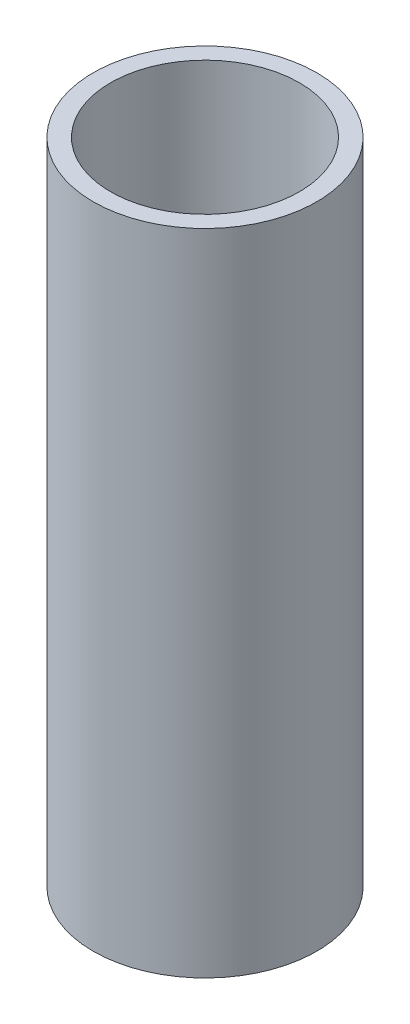
ISO-10303-21;
HEADER;
FILE_DESCRIPTION(('STEP AP214'),'2;1');
FILE_NAME('part.step','',(''),(''),'','','');
FILE_SCHEMA(('AUTOMOTIVE_DESIGN { 1 0 10303 214 1 1 1 1 }'));
ENDSEC;
DATA;
#1=APPLICATION_CONTEXT('core data for automotive mechanical design processes');
#2=APPLICATION_PROTOCOL_DEFINITION('international standard','automotive_design',2000,#1);
#3=PRODUCT_CONTEXT('',#1,'mechanical');
#4=PRODUCT('Part','Part','',(#3));
#5=PRODUCT_RELATED_PRODUCT_CATEGORY('part','',(#4));
#6=PRODUCT_DEFINITION_FORMATION('','',#4);
#7=PRODUCT_DEFINITION_CONTEXT('part definition',#1,'design');
#8=PRODUCT_DEFINITION('design','',#6,#7);
#9=PRODUCT_DEFINITION_SHAPE('','',#8);
#10=(LENGTH_UNIT() NAMED_UNIT(*) SI_UNIT(.MILLI.,.METRE.));
#11=(NAMED_UNIT(*) PLANE_ANGLE_UNIT() SI_UNIT($,.RADIAN.));
#12=(NAMED_UNIT(*) SI_UNIT($,.STERADIAN.) SOLID_ANGLE_UNIT());
#13=UNCERTAINTY_MEASURE_WITH_UNIT(LENGTH_MEASURE(1.E-05),#10,'distance_accuracy_value','');
#14=(GEOMETRIC_REPRESENTATION_CONTEXT(3) GLOBAL_UNCERTAINTY_ASSIGNED_CONTEXT((#13)) GLOBAL_UNIT_ASSIGNED_CONTEXT((#10,
#11,#12)) REPRESENTATION_CONTEXT('',''));
#15=CARTESIAN_POINT('',(0.,0.,0.));
#16=DIRECTION('',(0.,0.,1.));
#17=DIRECTION('',(1.,0.,0.));
#18=AXIS2_PLACEMENT_3D('',#15,#16,#17);
#19=CARTESIAN_POINT('',(0.,116.130624260028,0.));
#20=DIRECTION('',(0.,-1.,0.));
#21=DIRECTION('',(0.,0.,-1.));
#22=AXIS2_PLACEMENT_3D('',#19,#20,#21);
#23=CYLINDRICAL_SURFACE('',#22,20.);
#24=CARTESIAN_POINT('',(0.,116.130624260028,0.));
#25=DIRECTION('',(0.,1.,0.));
#26=DIRECTION('',(0.,0.,1.));
#27=AXIS2_PLACEMENT_3D('',#24,#25,#26);
#28=CIRCLE('',#27,20.);
#29=CARTESIAN_POINT('',(0.,116.130624260028,-20.));
#30=VERTEX_POINT('',#29);
#31=EDGE_CURVE('E10',#30,#30,#28,.T.);
#32=CARTESIAN_POINT('',(0.,0.,0.));
#33=DIRECTION('',(0.,1.,0.));
#34=DIRECTION('',(0.,0.,1.));
#35=AXIS2_PLACEMENT_3D('',#32,#33,#34);
#36=CIRCLE('',#35,20.);
#37=CARTESIAN_POINT('',(0.,0.,-20.));
#38=VERTEX_POINT('',#37);
#39=EDGE_CURVE('E37',#38,#38,#36,.T.);
#40=CARTESIAN_POINT('',(0.,116.130624260028,-20.));
#41=CARTESIAN_POINT('',(0.,114.920930257319,-20.));
#42=CARTESIAN_POINT('',(0.,113.711236254611,-20.));
#43=CARTESIAN_POINT('',(0.,111.291848249193,-20.));
#44=CARTESIAN_POINT('',(0.,110.082154246485,-20.));
#45=CARTESIAN_POINT('',(0.,107.662766241067,-20.));
#46=CARTESIAN_POINT('',(0.,106.453072238359,-20.));
#47=CARTESIAN_POINT('',(0.,104.033684232942,-20.));
#48=CARTESIAN_POINT('',(0.,102.823990230233,-20.));
#49=CARTESIAN_POINT('',(0.,100.404602224816,-20.));
#50=CARTESIAN_POINT('',(0.,99.1949082221071,-20.));
#51=CARTESIAN_POINT('',(0.,96.7755202166899,-20.));
#52=CARTESIAN_POINT('',(0.,95.5658262139813,-20.));
#53=CARTESIAN_POINT('',(0.,93.146438208564,-20.));
#54=CARTESIAN_POINT('',(0.,91.9367442058554,-20.));
#55=CARTESIAN_POINT('',(0.,89.5173562004381,-20.));
#56=CARTESIAN_POINT('',(0.,88.3076621977295,-20.));
#57=CARTESIAN_POINT('',(0.,85.8882741923123,-20.));
#58=CARTESIAN_POINT('',(0.,84.6785801896036,-20.));
#59=CARTESIAN_POINT('',(0.,82.2591921841864,-20.));
#60=CARTESIAN_POINT('',(0.,81.0494981814778,-20.));
#61=CARTESIAN_POINT('',(0.,78.6301101760605,-20.));
#62=CARTESIAN_POINT('',(0.,77.4204161733519,-20.));
#63=CARTESIAN_POINT('',(0.,75.0010281679347,-20.));
#64=CARTESIAN_POINT('',(0.,73.791334165226,-20.));
#65=CARTESIAN_POINT('',(0.,71.3719461598088,-20.));
#66=CARTESIAN_POINT('',(0.,70.1622521571002,-20.));
#67=CARTESIAN_POINT('',(0.,67.7428641516829,-20.));
#68=CARTESIAN_POINT('',(0.,66.5331701489743,-20.));
#69=CARTESIAN_POINT('',(0.,64.113782143557,-20.));
#70=CARTESIAN_POINT('',(0.,62.9040881408484,-20.));
#71=CARTESIAN_POINT('',(0.,60.4847001354312,-20.));
#72=CARTESIAN_POINT('',(0.,59.2750061327226,-20.));
#73=CARTESIAN_POINT('',(0.,56.8556181273053,-20.));
#74=CARTESIAN_POINT('',(0.,55.6459241245967,-20.));
#75=CARTESIAN_POINT('',(0.,53.2265361191794,-20.));
#76=CARTESIAN_POINT('',(0.,52.0168421164708,-20.));
#77=CARTESIAN_POINT('',(0.,49.5974541110536,-20.));
#78=CARTESIAN_POINT('',(0.,48.3877601083449,-20.));
#79=CARTESIAN_POINT('',(0.,45.9683721029277,-20.));
#80=CARTESIAN_POINT('',(0.,44.7586781002191,-20.));
#81=CARTESIAN_POINT('',(0.,42.3392900948018,-20.));
#82=CARTESIAN_POINT('',(0.,41.1295960920932,-20.));
#83=CARTESIAN_POINT('',(0.,38.710208086676,-20.));
#84=CARTESIAN_POINT('',(0.,37.5005140839673,-20.));
#85=CARTESIAN_POINT('',(0.,35.0811260785501,-20.));
#86=CARTESIAN_POINT('',(0.,33.8714320758415,-20.));
#87=CARTESIAN_POINT('',(0.,31.4520440704242,-20.));
#88=CARTESIAN_POINT('',(0.,30.2423500677156,-20.));
#89=CARTESIAN_POINT('',(0.,27.8229620622983,-20.));
#90=CARTESIAN_POINT('',(0.,26.6132680595897,-20.));
#91=CARTESIAN_POINT('',(0.,24.1938800541725,-20.));
#92=CARTESIAN_POINT('',(0.,22.9841860514639,-20.));
#93=CARTESIAN_POINT('',(0.,20.5647980460466,-20.));
#94=CARTESIAN_POINT('',(0.,19.355104043338,-20.));
#95=CARTESIAN_POINT('',(0.,16.9357160379207,-20.));
#96=CARTESIAN_POINT('',(0.,15.7260220352121,-20.));
#97=CARTESIAN_POINT('',(0.,13.3066340297949,-20.));
#98=CARTESIAN_POINT('',(0.,12.0969400270862,-20.));
#99=CARTESIAN_POINT('',(0.,9.67755202166899,-20.));
#100=CARTESIAN_POINT('',(0.,8.46785801896037,-20.));
#101=CARTESIAN_POINT('',(0.,6.04847001354312,-20.));
#102=CARTESIAN_POINT('',(0.,4.83877601083449,-20.));
#103=CARTESIAN_POINT('',(0.,2.41938800541724,-20.));
#104=CARTESIAN_POINT('',(0.,1.20969400270862,-20.));
#105=CARTESIAN_POINT('',(0.,0.,-20.));
#106=B_SPLINE_CURVE_WITH_KNOTS('',3,(#40,#41,#42,#43,#44,#45,#46,#47,#48,#49,#50,#51,#52,#53,
#54,#55,#56,#57,#58,#59,#60,#61,#62,#63,#64,#65,#66,#67,#68,#69,#70,#71,#72,#73,#74,#75,#76,#77,
#78,#79,#80,#81,#82,#83,#84,#85,#86,#87,#88,#89,#90,#91,#92,#93,#94,#95,#96,#97,#98,#99,#100,
#101,#102,#103,#104,#105),.UNSPECIFIED.,.F.,.F.,(4,2,2,2,2,2,2,2,2,2,2,2,2,2,2,2,2,2,2,2,2,2,2,
2,2,2,2,2,2,2,2,2,4),(0.,3.62908200812587,7.25816401625173,10.8872460243776,14.5163280325035,
18.1454100406293,21.7744920487552,25.4035740568811,29.032656065007,32.6617380731328,
36.2908200812587,39.9199020893846,43.5489840975104,47.1780661056363,50.8071481137622,
54.436230121888,58.0653121300139,61.6943941381398,65.3234761462657,68.9525581543915,
72.5816401625174,76.2107221706433,79.8398041787691,83.468886186895,87.0979681950209,
90.7270502031467,94.3561322112726,97.9852142193985,101.614296227524,105.24337823565,
108.872460243776,112.501542251902,116.130624260028),.UNSPECIFIED.);
#107=EDGE_CURVE('BSEAM40',#30,#38,#106,.T.);
#108=ORIENTED_EDGE('',*,*,#31,.F.);
#109=ORIENTED_EDGE('',*,*,#39,.T.);
#110=ORIENTED_EDGE('',*,*,#107,.T.);
#111=ORIENTED_EDGE('',*,*,#107,.F.);
#112=EDGE_LOOP('',(#108,#110,#109,#111));
#113=FACE_BOUND('',#112,.T.);
#114=ADVANCED_FACE('F40',(#113),#23,.T.);
#115=CARTESIAN_POINT('',(0.,116.130624260028,0.));
#116=DIRECTION('',(0.,1.,0.));
#117=DIRECTION('',(0.,0.,1.));
#118=AXIS2_PLACEMENT_3D('',#115,#116,#117);
#119=PLANE('',#118);
#120=CARTESIAN_POINT('',(0.,116.130624260028,0.));
#121=DIRECTION('',(0.,1.,0.));
#122=DIRECTION('',(0.,0.,1.));
#123=AXIS2_PLACEMENT_3D('',#120,#121,#122);
#124=CIRCLE('',#123,16.8988126896445);
#125=CARTESIAN_POINT('',(0.,116.130624260028,-16.8988126896445));
#126=VERTEX_POINT('',#125);
#127=EDGE_CURVE('E50',#126,#126,#124,.T.);
#128=ORIENTED_EDGE('',*,*,#127,.F.);
#129=EDGE_LOOP('',(#128));
#130=FACE_BOUND('',#129,.T.);
#131=ORIENTED_EDGE('',*,*,#31,.T.);
#132=EDGE_LOOP('',(#131));
#133=FACE_BOUND('',#132,.T.);
#134=ADVANCED_FACE('F59',(#130,#133),#119,.T.);
#135=CARTESIAN_POINT('',(0.,0.,0.));
#136=DIRECTION('',(0.,1.,0.));
#137=DIRECTION('',(0.,0.,1.));
#138=AXIS2_PLACEMENT_3D('',#135,#136,#137);
#139=PLANE('',#138);
#140=CARTESIAN_POINT('',(0.,0.,0.));
#141=DIRECTION('',(0.,1.,0.));
#142=DIRECTION('',(0.,0.,1.));
#143=AXIS2_PLACEMENT_3D('',#140,#141,#142);
#144=CIRCLE('',#143,16.8988126896445);
#145=CARTESIAN_POINT('',(0.,0.,-16.8988126896445));
#146=VERTEX_POINT('',#145);
#147=EDGE_CURVE('E47',#146,#146,#144,.T.);
#148=ORIENTED_EDGE('',*,*,#147,.T.);
#149=EDGE_LOOP('',(#148));
#150=FACE_BOUND('',#149,.T.);
#151=ORIENTED_EDGE('',*,*,#39,.F.);
#152=EDGE_LOOP('',(#151));
#153=FACE_BOUND('',#152,.T.);
#154=ADVANCED_FACE('F58',(#150,#153),#139,.F.);
#155=CARTESIAN_POINT('',(0.,116.130624260028,0.));
#156=DIRECTION('',(0.,-1.,0.));
#157=DIRECTION('',(0.,0.,-1.));
#158=AXIS2_PLACEMENT_3D('',#155,#156,#157);
#159=CYLINDRICAL_SURFACE('',#158,16.8988126896445);
#160=CARTESIAN_POINT('',(0.,116.130624260028,-16.8988126896445));
#161=CARTESIAN_POINT('',(0.,114.920930257319,-16.8988126896445));
#162=CARTESIAN_POINT('',(0.,113.711236254611,-16.8988126896445));
#163=CARTESIAN_POINT('',(0.,111.291848249193,-16.8988126896445));
#164=CARTESIAN_POINT('',(0.,110.082154246485,-16.8988126896445));
#165=CARTESIAN_POINT('',(0.,107.662766241067,-16.8988126896445));
#166=CARTESIAN_POINT('',(0.,106.453072238359,-16.8988126896445));
#167=CARTESIAN_POINT('',(0.,104.033684232942,-16.8988126896445));
#168=CARTESIAN_POINT('',(0.,102.823990230233,-16.8988126896445));
#169=CARTESIAN_POINT('',(0.,100.404602224816,-16.8988126896445));
#170=CARTESIAN_POINT('',(0.,99.1949082221071,-16.8988126896445));
#171=CARTESIAN_POINT('',(0.,96.7755202166899,-16.8988126896445));
#172=CARTESIAN_POINT('',(0.,95.5658262139813,-16.8988126896445));
#173=CARTESIAN_POINT('',(0.,93.146438208564,-16.8988126896445));
#174=CARTESIAN_POINT('',(0.,91.9367442058554,-16.8988126896445));
#175=CARTESIAN_POINT('',(0.,89.5173562004381,-16.8988126896445));
#176=CARTESIAN_POINT('',(0.,88.3076621977295,-16.8988126896445));
#177=CARTESIAN_POINT('',(0.,85.8882741923123,-16.8988126896445));
#178=CARTESIAN_POINT('',(0.,84.6785801896036,-16.8988126896445));
#179=CARTESIAN_POINT('',(0.,82.2591921841864,-16.8988126896445));
#180=CARTESIAN_POINT('',(0.,81.0494981814778,-16.8988126896445));
#181=CARTESIAN_POINT('',(0.,78.6301101760605,-16.8988126896445));
#182=CARTESIAN_POINT('',(0.,77.4204161733519,-16.8988126896445));
#183=CARTESIAN_POINT('',(0.,75.0010281679347,-16.8988126896445));
#184=CARTESIAN_POINT('',(0.,73.791334165226,-16.8988126896445));
#185=CARTESIAN_POINT('',(0.,71.3719461598088,-16.8988126896445));
#186=CARTESIAN_POINT('',(0.,70.1622521571002,-16.8988126896445));
#187=CARTESIAN_POINT('',(0.,67.7428641516829,-16.8988126896445));
#188=CARTESIAN_POINT('',(0.,66.5331701489743,-16.8988126896445));
#189=CARTESIAN_POINT('',(0.,64.113782143557,-16.8988126896445));
#190=CARTESIAN_POINT('',(0.,62.9040881408484,-16.8988126896445));
#191=CARTESIAN_POINT('',(0.,60.4847001354312,-16.8988126896445));
#192=CARTESIAN_POINT('',(0.,59.2750061327226,-16.8988126896445));
#193=CARTESIAN_POINT('',(0.,56.8556181273053,-16.8988126896445));
#194=CARTESIAN_POINT('',(0.,55.6459241245967,-16.8988126896445));
#195=CARTESIAN_POINT('',(0.,53.2265361191794,-16.8988126896445));
#196=CARTESIAN_POINT('',(0.,52.0168421164708,-16.8988126896445));
#197=CARTESIAN_POINT('',(0.,49.5974541110536,-16.8988126896445));
#198=CARTESIAN_POINT('',(0.,48.3877601083449,-16.8988126896445));
#199=CARTESIAN_POINT('',(0.,45.9683721029277,-16.8988126896445));
#200=CARTESIAN_POINT('',(0.,44.7586781002191,-16.8988126896445));
#201=CARTESIAN_POINT('',(0.,42.3392900948018,-16.8988126896445));
#202=CARTESIAN_POINT('',(0.,41.1295960920932,-16.8988126896445));
#203=CARTESIAN_POINT('',(0.,38.710208086676,-16.8988126896445));
#204=CARTESIAN_POINT('',(0.,37.5005140839673,-16.8988126896445));
#205=CARTESIAN_POINT('',(0.,35.0811260785501,-16.8988126896445));
#206=CARTESIAN_POINT('',(0.,33.8714320758415,-16.8988126896445));
#207=CARTESIAN_POINT('',(0.,31.4520440704242,-16.8988126896445));
#208=CARTESIAN_POINT('',(0.,30.2423500677156,-16.8988126896445));
#209=CARTESIAN_POINT('',(0.,27.8229620622983,-16.8988126896445));
#210=CARTESIAN_POINT('',(0.,26.6132680595897,-16.8988126896445));
#211=CARTESIAN_POINT('',(0.,24.1938800541725,-16.8988126896445));
#212=CARTESIAN_POINT('',(0.,22.9841860514639,-16.8988126896445));
#213=CARTESIAN_POINT('',(0.,20.5647980460466,-16.8988126896445));
#214=CARTESIAN_POINT('',(0.,19.355104043338,-16.8988126896445));
#215=CARTESIAN_POINT('',(0.,16.9357160379207,-16.8988126896445));
#216=CARTESIAN_POINT('',(0.,15.7260220352121,-16.8988126896445));
#217=CARTESIAN_POINT('',(0.,13.3066340297949,-16.8988126896445));
#218=CARTESIAN_POINT('',(0.,12.0969400270862,-16.8988126896445));
#219=CARTESIAN_POINT('',(0.,9.67755202166899,-16.8988126896445));
#220=CARTESIAN_POINT('',(0.,8.46785801896037,-16.8988126896445));
#221=CARTESIAN_POINT('',(0.,6.04847001354312,-16.8988126896445));
#222=CARTESIAN_POINT('',(0.,4.83877601083449,-16.8988126896445));
#223=CARTESIAN_POINT('',(0.,2.41938800541724,-16.8988126896445));
#224=CARTESIAN_POINT('',(0.,1.20969400270862,-16.8988126896445));
#225=CARTESIAN_POINT('',(0.,0.,-16.8988126896445));
#226=B_SPLINE_CURVE_WITH_KNOTS('',3,(#160,#161,#162,#163,#164,#165,#166,#167,#168,#169,#170,
#171,#172,#173,#174,#175,#176,#177,#178,#179,#180,#181,#182,#183,#184,#185,#186,#187,#188,#189,
#190,#191,#192,#193,#194,#195,#196,#197,#198,#199,#200,#201,#202,#203,#204,#205,#206,#207,#208,
#209,#210,#211,#212,#213,#214,#215,#216,#217,#218,#219,#220,#221,#222,#223,#224,#225),
.UNSPECIFIED.,.F.,.F.,(4,2,2,2,2,2,2,2,2,2,2,2,2,2,2,2,2,2,2,2,2,2,2,2,2,2,2,2,2,2,2,2,4),(0.,
3.62908200812587,7.25816401625173,10.8872460243776,14.5163280325035,18.1454100406293,
21.7744920487552,25.4035740568811,29.032656065007,32.6617380731328,36.2908200812587,
39.9199020893846,43.5489840975104,47.1780661056363,50.8071481137622,54.436230121888,
58.0653121300139,61.6943941381398,65.3234761462657,68.9525581543915,72.5816401625174,
76.2107221706433,79.8398041787691,83.468886186895,87.0979681950209,90.7270502031467,
94.3561322112726,97.9852142193985,101.614296227524,105.24337823565,108.872460243776,
112.501542251902,116.130624260028),.UNSPECIFIED.);
#227=EDGE_CURVE('BSEAM54',#126,#146,#226,.T.);
#228=ORIENTED_EDGE('',*,*,#127,.T.);
#229=ORIENTED_EDGE('',*,*,#147,.F.);
#230=ORIENTED_EDGE('',*,*,#227,.T.);
#231=ORIENTED_EDGE('',*,*,#227,.F.);
#232=EDGE_LOOP('',(#228,#230,#229,#231));
#233=FACE_BOUND('',#232,.T.);
#234=ADVANCED_FACE('F54',(#233),#159,.F.);
#235=CLOSED_SHELL('',(#114,#134,#154,#234));
#236=MANIFOLD_SOLID_BREP('B2',#235);
#237=ADVANCED_BREP_SHAPE_REPRESENTATION('',(#18,#236),#14);
#238=SHAPE_DEFINITION_REPRESENTATION(#9,#237);
ENDSEC;
END-ISO-10303-21;
